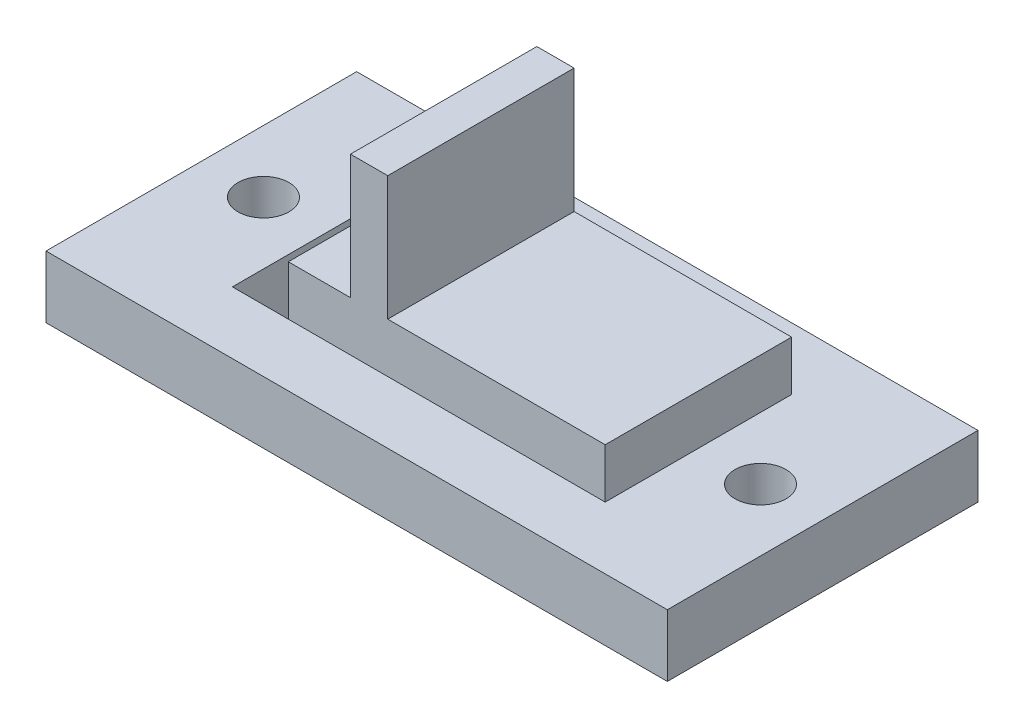
ISO-10303-21;
HEADER;
FILE_DESCRIPTION(('STEP AP214'),'2;1');
FILE_NAME('part.step','',(''),(''),'','','');
FILE_SCHEMA(('AUTOMOTIVE_DESIGN { 1 0 10303 214 1 1 1 1 }'));
ENDSEC;
DATA;
#1=APPLICATION_CONTEXT('core data for automotive mechanical design processes');
#2=APPLICATION_PROTOCOL_DEFINITION('international standard','automotive_design',2000,#1);
#3=PRODUCT_CONTEXT('',#1,'mechanical');
#4=PRODUCT('Part','Part','',(#3));
#5=PRODUCT_RELATED_PRODUCT_CATEGORY('part','',(#4));
#6=PRODUCT_DEFINITION_FORMATION('','',#4);
#7=PRODUCT_DEFINITION_CONTEXT('part definition',#1,'design');
#8=PRODUCT_DEFINITION('design','',#6,#7);
#9=PRODUCT_DEFINITION_SHAPE('','',#8);
#10=(LENGTH_UNIT() NAMED_UNIT(*) SI_UNIT(.MILLI.,.METRE.));
#11=(NAMED_UNIT(*) PLANE_ANGLE_UNIT() SI_UNIT($,.RADIAN.));
#12=(NAMED_UNIT(*) SI_UNIT($,.STERADIAN.) SOLID_ANGLE_UNIT());
#13=UNCERTAINTY_MEASURE_WITH_UNIT(LENGTH_MEASURE(1.E-05),#10,'distance_accuracy_value','');
#14=(GEOMETRIC_REPRESENTATION_CONTEXT(3) GLOBAL_UNCERTAINTY_ASSIGNED_CONTEXT((#13)) GLOBAL_UNIT_ASSIGNED_CONTEXT((#10,
#11,#12)) REPRESENTATION_CONTEXT('',''));
#15=CARTESIAN_POINT('',(0.,0.,0.));
#16=DIRECTION('',(0.,0.,1.));
#17=DIRECTION('',(1.,0.,0.));
#18=AXIS2_PLACEMENT_3D('',#15,#16,#17);
#19=CARTESIAN_POINT('',(0.,4.572,0.));
#20=DIRECTION('',(0.,-1.,0.));
#21=DIRECTION('',(0.,0.,-1.));
#22=AXIS2_PLACEMENT_3D('',#19,#20,#21);
#23=PLANE('',#22);
#24=DIRECTION('',(0.,0.,1.));
#25=VECTOR('',#24,1.);
#26=CARTESIAN_POINT('',(-2.79400000000001,4.572,-3.80999999999999));
#27=LINE('',#26,#25);
#28=CARTESIAN_POINT('',(-2.79400000000001,4.572,-3.80999999999999));
#29=VERTEX_POINT('',#28);
#30=CARTESIAN_POINT('',(-2.79400000000001,4.572,3.81));
#31=VERTEX_POINT('',#30);
#32=EDGE_CURVE('E170',#29,#31,#27,.T.);
#33=ORIENTED_EDGE('',*,*,#32,.F.);
#34=DIRECTION('',(-1.,0.,0.));
#35=VECTOR('',#34,1.);
#36=CARTESIAN_POINT('',(-7.62000000000001,4.572,-3.80999999999999));
#37=LINE('',#36,#35);
#38=CARTESIAN_POINT('',(-5.33400000000001,4.572,-3.80999999999999));
#39=VERTEX_POINT('',#38);
#40=EDGE_CURVE('E224',#29,#39,#37,.T.);
#41=ORIENTED_EDGE('',*,*,#40,.T.);
#42=DIRECTION('',(0.,0.,-1.));
#43=VECTOR('',#42,1.);
#44=CARTESIAN_POINT('',(-5.33400000000001,4.572,3.81));
#45=LINE('',#44,#43);
#46=CARTESIAN_POINT('',(-5.33400000000001,4.572,3.81));
#47=VERTEX_POINT('',#46);
#48=EDGE_CURVE('E171',#47,#39,#45,.T.);
#49=ORIENTED_EDGE('',*,*,#48,.F.);
#50=DIRECTION('',(1.,0.,0.));
#51=VECTOR('',#50,1.);
#52=CARTESIAN_POINT('',(-7.62000000000001,4.572,3.81));
#53=LINE('',#52,#51);
#54=EDGE_CURVE('E64',#47,#31,#53,.T.);
#55=ORIENTED_EDGE('',*,*,#54,.T.);
#56=EDGE_LOOP('',(#33,#41,#49,#55));
#57=FACE_BOUND('',#56,.T.);
#58=ADVANCED_FACE('F41',(#57),#23,.F.);
#59=DIRECTION('',(0.,0.,-1.));
#60=VECTOR('',#59,1.);
#61=CARTESIAN_POINT('',(-1.27000000000001,4.572,-3.80999999999999));
#62=LINE('',#61,#60);
#63=CARTESIAN_POINT('',(-1.27000000000001,4.572,3.81));
#64=VERTEX_POINT('',#63);
#65=CARTESIAN_POINT('',(-1.27000000000001,4.572,-3.80999999999999));
#66=VERTEX_POINT('',#65);
#67=EDGE_CURVE('E56',#64,#66,#62,.T.);
#68=ORIENTED_EDGE('',*,*,#67,.F.);
#69=CARTESIAN_POINT('',(7.62000000000001,4.572,3.81));
#70=VERTEX_POINT('',#69);
#71=EDGE_CURVE('E228',#64,#70,#53,.T.);
#72=ORIENTED_EDGE('',*,*,#71,.T.);
#73=DIRECTION('',(0.,0.,-1.));
#74=VECTOR('',#73,1.);
#75=CARTESIAN_POINT('',(7.62000000000001,4.572,3.81));
#76=LINE('',#75,#74);
#77=CARTESIAN_POINT('',(7.62000000000001,4.572,-3.80999999999999));
#78=VERTEX_POINT('',#77);
#79=EDGE_CURVE('E221',#70,#78,#76,.T.);
#80=ORIENTED_EDGE('',*,*,#79,.T.);
#81=EDGE_CURVE('E226',#78,#66,#37,.T.);
#82=ORIENTED_EDGE('',*,*,#81,.T.);
#83=EDGE_LOOP('',(#68,#72,#80,#82));
#84=FACE_BOUND('',#83,.T.);
#85=ADVANCED_FACE('F299',(#84),#23,.F.);
#86=CARTESIAN_POINT('',(0.,2.54,0.));
#87=DIRECTION('',(0.,-1.,0.));
#88=DIRECTION('',(0.,0.,-1.));
#89=AXIS2_PLACEMENT_3D('',#86,#87,#88);
#90=PLANE('',#89);
#91=CARTESIAN_POINT('',(-10.16,2.54,0.));
#92=DIRECTION('',(0.,-1.,0.));
#93=DIRECTION('',(0.,0.,-1.));
#94=AXIS2_PLACEMENT_3D('',#91,#92,#93);
#95=CIRCLE('',#94,1.0414);
#96=CARTESIAN_POINT('',(-10.16,2.54,-1.0414));
#97=VERTEX_POINT('',#96);
#98=EDGE_CURVE('E217',#97,#97,#95,.T.);
#99=ORIENTED_EDGE('',*,*,#98,.T.);
#100=EDGE_LOOP('',(#99));
#101=FACE_BOUND('',#100,.T.);
#102=CARTESIAN_POINT('',(10.16,2.54,0.));
#103=DIRECTION('',(0.,-1.,0.));
#104=DIRECTION('',(0.,0.,-1.));
#105=AXIS2_PLACEMENT_3D('',#102,#103,#104);
#106=CIRCLE('',#105,1.0414);
#107=CARTESIAN_POINT('',(10.16,2.54,-1.0414));
#108=VERTEX_POINT('',#107);
#109=EDGE_CURVE('E212',#108,#108,#106,.T.);
#110=ORIENTED_EDGE('',*,*,#109,.T.);
#111=EDGE_LOOP('',(#110));
#112=FACE_BOUND('',#111,.T.);
#113=DIRECTION('',(0.,0.,-1.));
#114=VECTOR('',#113,1.);
#115=CARTESIAN_POINT('',(12.7,2.54,6.35));
#116=LINE('',#115,#114);
#117=CARTESIAN_POINT('',(12.7,2.54,6.35));
#118=VERTEX_POINT('',#117);
#119=CARTESIAN_POINT('',(12.7,2.54,-6.34999999999999));
#120=VERTEX_POINT('',#119);
#121=EDGE_CURVE('E246',#118,#120,#116,.T.);
#122=ORIENTED_EDGE('',*,*,#121,.T.);
#123=DIRECTION('',(-1.,0.,0.));
#124=VECTOR('',#123,1.);
#125=CARTESIAN_POINT('',(-12.7,2.54,-6.34999999999999));
#126=LINE('',#125,#124);
#127=CARTESIAN_POINT('',(-12.7,2.54,-6.34999999999999));
#128=VERTEX_POINT('',#127);
#129=EDGE_CURVE('E249',#120,#128,#126,.T.);
#130=ORIENTED_EDGE('',*,*,#129,.T.);
#131=DIRECTION('',(0.,0.,1.));
#132=VECTOR('',#131,1.);
#133=CARTESIAN_POINT('',(-12.7,2.54,6.35));
#134=LINE('',#133,#132);
#135=CARTESIAN_POINT('',(-12.7,2.54,6.35));
#136=VERTEX_POINT('',#135);
#137=EDGE_CURVE('E252',#128,#136,#134,.T.);
#138=ORIENTED_EDGE('',*,*,#137,.T.);
#139=DIRECTION('',(1.,0.,0.));
#140=VECTOR('',#139,1.);
#141=CARTESIAN_POINT('',(-12.7,2.54,6.35));
#142=LINE('',#141,#140);
#143=EDGE_CURVE('E254',#136,#118,#142,.T.);
#144=ORIENTED_EDGE('',*,*,#143,.T.);
#145=EDGE_LOOP('',(#122,#130,#138,#144));
#146=FACE_BOUND('',#145,.T.);
#147=DIRECTION('',(0.,0.,-1.));
#148=VECTOR('',#147,1.);
#149=CARTESIAN_POINT('',(7.62000000000001,2.54,3.81));
#150=LINE('',#149,#148);
#151=CARTESIAN_POINT('',(7.62000000000001,2.54,3.81));
#152=VERTEX_POINT('',#151);
#153=CARTESIAN_POINT('',(7.62000000000001,2.54,-3.80999999999999));
#154=VERTEX_POINT('',#153);
#155=EDGE_CURVE('E220',#152,#154,#150,.T.);
#156=ORIENTED_EDGE('',*,*,#155,.F.);
#157=DIRECTION('',(1.,0.,0.));
#158=VECTOR('',#157,1.);
#159=CARTESIAN_POINT('',(-7.62000000000001,2.54,3.81));
#160=LINE('',#159,#158);
#161=CARTESIAN_POINT('',(-5.33400000000001,2.54,3.81));
#162=VERTEX_POINT('',#161);
#163=EDGE_CURVE('E238',#162,#152,#160,.T.);
#164=ORIENTED_EDGE('',*,*,#163,.F.);
#165=CARTESIAN_POINT('',(-7.62000000000001,2.54,3.81));
#166=VERTEX_POINT('',#165);
#167=EDGE_CURVE('E225',#166,#162,#160,.T.);
#168=ORIENTED_EDGE('',*,*,#167,.F.);
#169=DIRECTION('',(0.,0.,1.));
#170=VECTOR('',#169,1.);
#171=CARTESIAN_POINT('',(-7.62000000000001,2.54,3.81));
#172=LINE('',#171,#170);
#173=CARTESIAN_POINT('',(-7.62000000000001,2.54,-3.80999999999999));
#174=VERTEX_POINT('',#173);
#175=EDGE_CURVE('E236',#174,#166,#172,.T.);
#176=ORIENTED_EDGE('',*,*,#175,.F.);
#177=DIRECTION('',(1.,0.,0.));
#178=VECTOR('',#177,1.);
#179=CARTESIAN_POINT('',(0.,2.54,-3.80999999999999));
#180=LINE('',#179,#178);
#181=CARTESIAN_POINT('',(-5.33400000000001,2.54,-3.80999999999999));
#182=VERTEX_POINT('',#181);
#183=EDGE_CURVE('E205',#174,#182,#180,.T.);
#184=ORIENTED_EDGE('',*,*,#183,.T.);
#185=DIRECTION('',(-1.,0.,0.));
#186=VECTOR('',#185,1.);
#187=CARTESIAN_POINT('',(-7.62000000000001,2.54,-3.80999999999999));
#188=LINE('',#187,#186);
#189=EDGE_CURVE('E233',#154,#182,#188,.T.);
#190=ORIENTED_EDGE('',*,*,#189,.F.);
#191=EDGE_LOOP('',(#156,#164,#168,#176,#184,#190));
#192=FACE_BOUND('',#191,.T.);
#193=ADVANCED_FACE('F289',(#101,#112,#146,#192),#90,.F.);
#194=CARTESIAN_POINT('',(12.7,2.54,6.35));
#195=DIRECTION('',(-1.,0.,0.));
#196=DIRECTION('',(0.,0.,1.));
#197=AXIS2_PLACEMENT_3D('',#194,#195,#196);
#198=PLANE('',#197);
#199=DIRECTION('',(0.,0.,-1.));
#200=VECTOR('',#199,1.);
#201=CARTESIAN_POINT('',(12.7,0.,6.35));
#202=LINE('',#201,#200);
#203=CARTESIAN_POINT('',(12.7,0.,6.35));
#204=VERTEX_POINT('',#203);
#205=CARTESIAN_POINT('',(12.7,0.,-6.34999999999999));
#206=VERTEX_POINT('',#205);
#207=EDGE_CURVE('E245',#204,#206,#202,.T.);
#208=ORIENTED_EDGE('',*,*,#207,.T.);
#209=DIRECTION('',(0.,-1.,0.));
#210=VECTOR('',#209,1.);
#211=CARTESIAN_POINT('',(12.7,2.54,-6.34999999999999));
#212=LINE('',#211,#210);
#213=EDGE_CURVE('E11',#120,#206,#212,.T.);
#214=ORIENTED_EDGE('',*,*,#213,.F.);
#215=ORIENTED_EDGE('',*,*,#121,.F.);
#216=DIRECTION('',(0.,-1.,0.));
#217=VECTOR('',#216,1.);
#218=CARTESIAN_POINT('',(12.7,2.54,6.35));
#219=LINE('',#218,#217);
#220=EDGE_CURVE('E256',#118,#204,#219,.T.);
#221=ORIENTED_EDGE('',*,*,#220,.T.);
#222=EDGE_LOOP('',(#208,#214,#215,#221));
#223=FACE_BOUND('',#222,.T.);
#224=ADVANCED_FACE('F43',(#223),#198,.F.);
#225=CARTESIAN_POINT('',(-12.7,2.54,-6.34999999999999));
#226=DIRECTION('',(0.,0.,1.));
#227=DIRECTION('',(1.,0.,0.));
#228=AXIS2_PLACEMENT_3D('',#225,#226,#227);
#229=PLANE('',#228);
#230=DIRECTION('',(-1.,0.,0.));
#231=VECTOR('',#230,1.);
#232=CARTESIAN_POINT('',(-12.7,0.,-6.34999999999999));
#233=LINE('',#232,#231);
#234=CARTESIAN_POINT('',(-12.7,0.,-6.34999999999999));
#235=VERTEX_POINT('',#234);
#236=EDGE_CURVE('E259',#206,#235,#233,.T.);
#237=ORIENTED_EDGE('',*,*,#236,.T.);
#238=DIRECTION('',(0.,-1.,0.));
#239=VECTOR('',#238,1.);
#240=CARTESIAN_POINT('',(-12.7,2.54,-6.34999999999999));
#241=LINE('',#240,#239);
#242=EDGE_CURVE('E49',#128,#235,#241,.T.);
#243=ORIENTED_EDGE('',*,*,#242,.F.);
#244=ORIENTED_EDGE('',*,*,#129,.F.);
#245=ORIENTED_EDGE('',*,*,#213,.T.);
#246=EDGE_LOOP('',(#237,#243,#244,#245));
#247=FACE_BOUND('',#246,.T.);
#248=ADVANCED_FACE('F291',(#247),#229,.F.);
#249=CARTESIAN_POINT('',(-12.7,2.54,6.35));
#250=DIRECTION('',(1.,0.,0.));
#251=DIRECTION('',(0.,0.,-1.));
#252=AXIS2_PLACEMENT_3D('',#249,#250,#251);
#253=PLANE('',#252);
#254=DIRECTION('',(0.,0.,1.));
#255=VECTOR('',#254,1.);
#256=CARTESIAN_POINT('',(-12.7,0.,6.35));
#257=LINE('',#256,#255);
#258=CARTESIAN_POINT('',(-12.7,0.,6.35));
#259=VERTEX_POINT('',#258);
#260=EDGE_CURVE('E262',#235,#259,#257,.T.);
#261=ORIENTED_EDGE('',*,*,#260,.T.);
#262=DIRECTION('',(0.,-1.,0.));
#263=VECTOR('',#262,1.);
#264=CARTESIAN_POINT('',(-12.7,2.54,6.35));
#265=LINE('',#264,#263);
#266=EDGE_CURVE('E267',#136,#259,#265,.T.);
#267=ORIENTED_EDGE('',*,*,#266,.F.);
#268=ORIENTED_EDGE('',*,*,#137,.F.);
#269=ORIENTED_EDGE('',*,*,#242,.T.);
#270=EDGE_LOOP('',(#261,#267,#268,#269));
#271=FACE_BOUND('',#270,.T.);
#272=ADVANCED_FACE('F274',(#271),#253,.F.);
#273=CARTESIAN_POINT('',(-12.7,2.54,6.35));
#274=DIRECTION('',(0.,0.,-1.));
#275=DIRECTION('',(-1.,0.,0.));
#276=AXIS2_PLACEMENT_3D('',#273,#274,#275);
#277=PLANE('',#276);
#278=DIRECTION('',(1.,0.,0.));
#279=VECTOR('',#278,1.);
#280=CARTESIAN_POINT('',(-12.7,0.,6.35));
#281=LINE('',#280,#279);
#282=EDGE_CURVE('E250',#259,#204,#281,.T.);
#283=ORIENTED_EDGE('',*,*,#282,.T.);
#284=ORIENTED_EDGE('',*,*,#220,.F.);
#285=ORIENTED_EDGE('',*,*,#143,.F.);
#286=ORIENTED_EDGE('',*,*,#266,.T.);
#287=EDGE_LOOP('',(#283,#284,#285,#286));
#288=FACE_BOUND('',#287,.T.);
#289=ADVANCED_FACE('F283',(#288),#277,.F.);
#290=CARTESIAN_POINT('',(0.,0.,0.));
#291=DIRECTION('',(0.,-1.,0.));
#292=DIRECTION('',(0.,0.,-1.));
#293=AXIS2_PLACEMENT_3D('',#290,#291,#292);
#294=PLANE('',#293);
#295=DIRECTION('',(1.,0.,0.));
#296=VECTOR('',#295,1.);
#297=CARTESIAN_POINT('',(-7.62000000000001,0.,3.81));
#298=LINE('',#297,#296);
#299=CARTESIAN_POINT('',(-7.62000000000001,0.,3.81));
#300=VERTEX_POINT('',#299);
#301=CARTESIAN_POINT('',(-5.33400000000001,0.,3.81));
#302=VERTEX_POINT('',#301);
#303=EDGE_CURVE('E174',#300,#302,#298,.T.);
#304=ORIENTED_EDGE('',*,*,#303,.T.);
#305=DIRECTION('',(0.,0.,-1.));
#306=VECTOR('',#305,1.);
#307=CARTESIAN_POINT('',(-5.33400000000001,0.,3.81));
#308=LINE('',#307,#306);
#309=CARTESIAN_POINT('',(-5.33400000000001,0.,-3.80999999999999));
#310=VERTEX_POINT('',#309);
#311=EDGE_CURVE('E192',#302,#310,#308,.T.);
#312=ORIENTED_EDGE('',*,*,#311,.T.);
#313=DIRECTION('',(-1.,0.,0.));
#314=VECTOR('',#313,1.);
#315=CARTESIAN_POINT('',(-7.62000000000001,0.,-3.80999999999999));
#316=LINE('',#315,#314);
#317=CARTESIAN_POINT('',(-7.62000000000001,0.,-3.80999999999999));
#318=VERTEX_POINT('',#317);
#319=EDGE_CURVE('E188',#310,#318,#316,.T.);
#320=ORIENTED_EDGE('',*,*,#319,.T.);
#321=DIRECTION('',(0.,0.,1.));
#322=VECTOR('',#321,1.);
#323=CARTESIAN_POINT('',(-7.62000000000001,0.,3.81));
#324=LINE('',#323,#322);
#325=EDGE_CURVE('E183',#318,#300,#324,.T.);
#326=ORIENTED_EDGE('',*,*,#325,.T.);
#327=EDGE_LOOP('',(#304,#312,#320,#326));
#328=FACE_BOUND('',#327,.T.);
#329=CARTESIAN_POINT('',(-10.16,0.,0.));
#330=DIRECTION('',(0.,-1.,0.));
#331=DIRECTION('',(0.,0.,-1.));
#332=AXIS2_PLACEMENT_3D('',#329,#330,#331);
#333=CIRCLE('',#332,1.0414);
#334=CARTESIAN_POINT('',(-10.16,0.,-1.0414));
#335=VERTEX_POINT('',#334);
#336=EDGE_CURVE('E209',#335,#335,#333,.T.);
#337=ORIENTED_EDGE('',*,*,#336,.F.);
#338=EDGE_LOOP('',(#337));
#339=FACE_BOUND('',#338,.T.);
#340=CARTESIAN_POINT('',(10.16,0.,0.));
#341=DIRECTION('',(0.,-1.,0.));
#342=DIRECTION('',(0.,0.,-1.));
#343=AXIS2_PLACEMENT_3D('',#340,#341,#342);
#344=CIRCLE('',#343,1.0414);
#345=CARTESIAN_POINT('',(10.16,0.,-1.0414));
#346=VERTEX_POINT('',#345);
#347=EDGE_CURVE('E208',#346,#346,#344,.T.);
#348=ORIENTED_EDGE('',*,*,#347,.F.);
#349=EDGE_LOOP('',(#348));
#350=FACE_BOUND('',#349,.T.);
#351=ORIENTED_EDGE('',*,*,#207,.F.);
#352=ORIENTED_EDGE('',*,*,#282,.F.);
#353=ORIENTED_EDGE('',*,*,#260,.F.);
#354=ORIENTED_EDGE('',*,*,#236,.F.);
#355=EDGE_LOOP('',(#351,#352,#353,#354));
#356=FACE_BOUND('',#355,.T.);
#357=ADVANCED_FACE('F280',(#328,#339,#350,#356),#294,.T.);
#358=CARTESIAN_POINT('',(7.62000000000001,4.572,3.81));
#359=DIRECTION('',(-1.,0.,0.));
#360=DIRECTION('',(0.,0.,1.));
#361=AXIS2_PLACEMENT_3D('',#358,#359,#360);
#362=PLANE('',#361);
#363=ORIENTED_EDGE('',*,*,#155,.T.);
#364=DIRECTION('',(0.,-1.,0.));
#365=VECTOR('',#364,1.);
#366=CARTESIAN_POINT('',(7.62000000000001,4.572,-3.80999999999999));
#367=LINE('',#366,#365);
#368=EDGE_CURVE('E242',#78,#154,#367,.T.);
#369=ORIENTED_EDGE('',*,*,#368,.F.);
#370=ORIENTED_EDGE('',*,*,#79,.F.);
#371=DIRECTION('',(0.,-1.,0.));
#372=VECTOR('',#371,1.);
#373=CARTESIAN_POINT('',(7.62000000000001,4.572,3.81));
#374=LINE('',#373,#372);
#375=EDGE_CURVE('E230',#70,#152,#374,.T.);
#376=ORIENTED_EDGE('',*,*,#375,.T.);
#377=EDGE_LOOP('',(#363,#369,#370,#376));
#378=FACE_BOUND('',#377,.T.);
#379=ADVANCED_FACE('F314',(#378),#362,.F.);
#380=CARTESIAN_POINT('',(-7.62000000000001,4.572,-3.80999999999999));
#381=DIRECTION('',(0.,0.,1.));
#382=DIRECTION('',(1.,0.,0.));
#383=AXIS2_PLACEMENT_3D('',#380,#381,#382);
#384=PLANE('',#383);
#385=ORIENTED_EDGE('',*,*,#189,.T.);
#386=DIRECTION('',(0.,1.,0.));
#387=VECTOR('',#386,1.);
#388=CARTESIAN_POINT('',(-5.33400000000001,-7.95551355978983,-3.80999999999999));
#389=LINE('',#388,#387);
#390=EDGE_CURVE('E195',#182,#39,#389,.T.);
#391=ORIENTED_EDGE('',*,*,#390,.T.);
#392=ORIENTED_EDGE('',*,*,#40,.F.);
#393=DIRECTION('',(0.,-1.,0.));
#394=VECTOR('',#393,1.);
#395=CARTESIAN_POINT('',(-2.79400000000001,9.652,-3.80999999999999));
#396=LINE('',#395,#394);
#397=CARTESIAN_POINT('',(-2.79400000000001,9.652,-3.80999999999999));
#398=VERTEX_POINT('',#397);
#399=EDGE_CURVE('E457',#398,#29,#396,.T.);
#400=ORIENTED_EDGE('',*,*,#399,.F.);
#401=DIRECTION('',(-1.,0.,0.));
#402=VECTOR('',#401,1.);
#403=CARTESIAN_POINT('',(-2.79400000000001,9.652,-3.80999999999999));
#404=LINE('',#403,#402);
#405=CARTESIAN_POINT('',(-1.27000000000001,9.652,-3.80999999999999));
#406=VERTEX_POINT('',#405);
#407=EDGE_CURVE('E164',#406,#398,#404,.T.);
#408=ORIENTED_EDGE('',*,*,#407,.F.);
#409=DIRECTION('',(0.,-1.,0.));
#410=VECTOR('',#409,1.);
#411=CARTESIAN_POINT('',(-1.27000000000001,9.652,-3.80999999999999));
#412=LINE('',#411,#410);
#413=EDGE_CURVE('E176',#406,#66,#412,.T.);
#414=ORIENTED_EDGE('',*,*,#413,.T.);
#415=ORIENTED_EDGE('',*,*,#81,.F.);
#416=ORIENTED_EDGE('',*,*,#368,.T.);
#417=EDGE_LOOP('',(#385,#391,#392,#400,#408,#414,#415,#416));
#418=FACE_BOUND('',#417,.T.);
#419=ADVANCED_FACE('F311',(#418),#384,.F.);
#420=CARTESIAN_POINT('',(-7.62000000000001,4.572,3.81));
#421=DIRECTION('',(0.,0.,-1.));
#422=DIRECTION('',(-1.,0.,0.));
#423=AXIS2_PLACEMENT_3D('',#420,#421,#422);
#424=PLANE('',#423);
#425=ORIENTED_EDGE('',*,*,#54,.F.);
#426=DIRECTION('',(0.,1.,0.));
#427=VECTOR('',#426,1.);
#428=CARTESIAN_POINT('',(-5.33400000000001,-7.95551355978983,3.81));
#429=LINE('',#428,#427);
#430=EDGE_CURVE('E182',#162,#47,#429,.T.);
#431=ORIENTED_EDGE('',*,*,#430,.F.);
#432=ORIENTED_EDGE('',*,*,#163,.T.);
#433=ORIENTED_EDGE('',*,*,#375,.F.);
#434=ORIENTED_EDGE('',*,*,#71,.F.);
#435=DIRECTION('',(0.,-1.,0.));
#436=VECTOR('',#435,1.);
#437=CARTESIAN_POINT('',(-1.27000000000001,9.652,3.81));
#438=LINE('',#437,#436);
#439=CARTESIAN_POINT('',(-1.27000000000001,9.652,3.81));
#440=VERTEX_POINT('',#439);
#441=EDGE_CURVE('E155',#440,#64,#438,.T.);
#442=ORIENTED_EDGE('',*,*,#441,.F.);
#443=DIRECTION('',(1.,0.,0.));
#444=VECTOR('',#443,1.);
#445=CARTESIAN_POINT('',(-2.79400000000001,9.652,3.81));
#446=LINE('',#445,#444);
#447=CARTESIAN_POINT('',(-2.79400000000001,9.652,3.81));
#448=VERTEX_POINT('',#447);
#449=EDGE_CURVE('E148',#448,#440,#446,.T.);
#450=ORIENTED_EDGE('',*,*,#449,.F.);
#451=DIRECTION('',(0.,-1.,0.));
#452=VECTOR('',#451,1.);
#453=CARTESIAN_POINT('',(-2.79400000000001,9.652,3.81));
#454=LINE('',#453,#452);
#455=EDGE_CURVE('E152',#448,#31,#454,.T.);
#456=ORIENTED_EDGE('',*,*,#455,.T.);
#457=EDGE_LOOP('',(#425,#431,#432,#433,#434,#442,#450,#456));
#458=FACE_BOUND('',#457,.T.);
#459=ADVANCED_FACE('F150',(#458),#424,.F.);
#460=CARTESIAN_POINT('',(10.16,4.572,0.));
#461=DIRECTION('',(0.,-1.,0.));
#462=DIRECTION('',(0.,0.,-1.));
#463=AXIS2_PLACEMENT_3D('',#460,#461,#462);
#464=CYLINDRICAL_SURFACE('',#463,1.0414);
#465=ORIENTED_EDGE('',*,*,#347,.T.);
#466=EDGE_LOOP('',(#465));
#467=FACE_BOUND('',#466,.T.);
#468=ORIENTED_EDGE('',*,*,#109,.F.);
#469=EDGE_LOOP('',(#468));
#470=FACE_BOUND('',#469,.T.);
#471=ADVANCED_FACE('F307',(#467,#470),#464,.F.);
#472=CARTESIAN_POINT('',(-10.16,4.572,0.));
#473=DIRECTION('',(0.,-1.,0.));
#474=DIRECTION('',(0.,0.,-1.));
#475=AXIS2_PLACEMENT_3D('',#472,#473,#474);
#476=CYLINDRICAL_SURFACE('',#475,1.0414);
#477=ORIENTED_EDGE('',*,*,#336,.T.);
#478=EDGE_LOOP('',(#477));
#479=FACE_BOUND('',#478,.T.);
#480=ORIENTED_EDGE('',*,*,#98,.F.);
#481=EDGE_LOOP('',(#480));
#482=FACE_BOUND('',#481,.T.);
#483=ADVANCED_FACE('F373',(#479,#482),#476,.F.);
#484=CARTESIAN_POINT('',(-7.62000000000001,-7.95551355978983,3.81));
#485=DIRECTION('',(0.,0.,1.));
#486=DIRECTION('',(1.,0.,0.));
#487=AXIS2_PLACEMENT_3D('',#484,#485,#486);
#488=PLANE('',#487);
#489=EDGE_CURVE('E196',#302,#162,#429,.T.);
#490=ORIENTED_EDGE('',*,*,#489,.F.);
#491=ORIENTED_EDGE('',*,*,#303,.F.);
#492=DIRECTION('',(0.,1.,0.));
#493=VECTOR('',#492,1.);
#494=CARTESIAN_POINT('',(-7.62000000000001,-7.95551355978983,3.81));
#495=LINE('',#494,#493);
#496=EDGE_CURVE('E186',#300,#166,#495,.T.);
#497=ORIENTED_EDGE('',*,*,#496,.T.);
#498=ORIENTED_EDGE('',*,*,#167,.T.);
#499=EDGE_LOOP('',(#490,#491,#497,#498));
#500=FACE_BOUND('',#499,.T.);
#501=ADVANCED_FACE('F380',(#500),#488,.F.);
#502=CARTESIAN_POINT('',(-7.62000000000001,-7.95551355978983,-3.80999999999999));
#503=DIRECTION('',(0.,0.,-1.));
#504=DIRECTION('',(-1.,0.,0.));
#505=AXIS2_PLACEMENT_3D('',#502,#503,#504);
#506=PLANE('',#505);
#507=DIRECTION('',(0.,1.,0.));
#508=VECTOR('',#507,1.);
#509=CARTESIAN_POINT('',(-7.62000000000001,-7.95551355978983,-3.80999999999999));
#510=LINE('',#509,#508);
#511=EDGE_CURVE('E187',#318,#174,#510,.T.);
#512=ORIENTED_EDGE('',*,*,#511,.F.);
#513=ORIENTED_EDGE('',*,*,#319,.F.);
#514=EDGE_CURVE('E191',#310,#182,#389,.T.);
#515=ORIENTED_EDGE('',*,*,#514,.T.);
#516=ORIENTED_EDGE('',*,*,#183,.F.);
#517=EDGE_LOOP('',(#512,#513,#515,#516));
#518=FACE_BOUND('',#517,.T.);
#519=ADVANCED_FACE('F387',(#518),#506,.F.);
#520=CARTESIAN_POINT('',(-7.62000000000001,-7.95551355978983,3.81));
#521=DIRECTION('',(-1.,0.,0.));
#522=DIRECTION('',(0.,0.,1.));
#523=AXIS2_PLACEMENT_3D('',#520,#521,#522);
#524=PLANE('',#523);
#525=ORIENTED_EDGE('',*,*,#496,.F.);
#526=ORIENTED_EDGE('',*,*,#325,.F.);
#527=ORIENTED_EDGE('',*,*,#511,.T.);
#528=ORIENTED_EDGE('',*,*,#175,.T.);
#529=EDGE_LOOP('',(#525,#526,#527,#528));
#530=FACE_BOUND('',#529,.T.);
#531=ADVANCED_FACE('F396',(#530),#524,.F.);
#532=CARTESIAN_POINT('',(-5.33400000000001,-7.95551355978983,3.81));
#533=DIRECTION('',(1.,0.,0.));
#534=DIRECTION('',(0.,0.,-1.));
#535=AXIS2_PLACEMENT_3D('',#532,#533,#534);
#536=PLANE('',#535);
#537=ORIENTED_EDGE('',*,*,#489,.T.);
#538=ORIENTED_EDGE('',*,*,#430,.T.);
#539=ORIENTED_EDGE('',*,*,#48,.T.);
#540=ORIENTED_EDGE('',*,*,#390,.F.);
#541=ORIENTED_EDGE('',*,*,#514,.F.);
#542=ORIENTED_EDGE('',*,*,#311,.F.);
#543=EDGE_LOOP('',(#537,#538,#539,#540,#541,#542));
#544=FACE_BOUND('',#543,.T.);
#545=ADVANCED_FACE('F405',(#544),#536,.F.);
#546=CARTESIAN_POINT('',(-2.79400000000001,9.652,-3.80999999999999));
#547=DIRECTION('',(1.,0.,0.));
#548=DIRECTION('',(0.,0.,-1.));
#549=AXIS2_PLACEMENT_3D('',#546,#547,#548);
#550=PLANE('',#549);
#551=ORIENTED_EDGE('',*,*,#32,.T.);
#552=ORIENTED_EDGE('',*,*,#455,.F.);
#553=DIRECTION('',(0.,0.,1.));
#554=VECTOR('',#553,1.);
#555=CARTESIAN_POINT('',(-2.79400000000001,9.652,-3.80999999999999));
#556=LINE('',#555,#554);
#557=EDGE_CURVE('E159',#398,#448,#556,.T.);
#558=ORIENTED_EDGE('',*,*,#557,.F.);
#559=ORIENTED_EDGE('',*,*,#399,.T.);
#560=EDGE_LOOP('',(#551,#552,#558,#559));
#561=FACE_BOUND('',#560,.T.);
#562=ADVANCED_FACE('F169',(#561),#550,.F.);
#563=CARTESIAN_POINT('',(-1.27000000000001,9.652,-3.80999999999999));
#564=DIRECTION('',(-1.,0.,0.));
#565=DIRECTION('',(0.,0.,1.));
#566=AXIS2_PLACEMENT_3D('',#563,#564,#565);
#567=PLANE('',#566);
#568=ORIENTED_EDGE('',*,*,#67,.T.);
#569=ORIENTED_EDGE('',*,*,#413,.F.);
#570=DIRECTION('',(0.,0.,-1.));
#571=VECTOR('',#570,1.);
#572=CARTESIAN_POINT('',(-1.27000000000001,9.652,-3.80999999999999));
#573=LINE('',#572,#571);
#574=EDGE_CURVE('E158',#440,#406,#573,.T.);
#575=ORIENTED_EDGE('',*,*,#574,.F.);
#576=ORIENTED_EDGE('',*,*,#441,.T.);
#577=EDGE_LOOP('',(#568,#569,#575,#576));
#578=FACE_BOUND('',#577,.T.);
#579=ADVANCED_FACE('F433',(#578),#567,.F.);
#580=CARTESIAN_POINT('',(0.,9.652,0.));
#581=DIRECTION('',(0.,1.,0.));
#582=DIRECTION('',(0.,0.,1.));
#583=AXIS2_PLACEMENT_3D('',#580,#581,#582);
#584=PLANE('',#583);
#585=ORIENTED_EDGE('',*,*,#557,.T.);
#586=ORIENTED_EDGE('',*,*,#449,.T.);
#587=ORIENTED_EDGE('',*,*,#574,.T.);
#588=ORIENTED_EDGE('',*,*,#407,.T.);
#589=EDGE_LOOP('',(#585,#586,#587,#588));
#590=FACE_BOUND('',#589,.T.);
#591=ADVANCED_FACE('F162',(#590),#584,.T.);
#592=CLOSED_SHELL('',(#58,#85,#193,#224,#248,#272,#289,#357,#379,#419,#459,#471,#483,#501,#519,
#531,#545,#562,#579,#591));
#593=MANIFOLD_SOLID_BREP('B2',#592);
#594=ADVANCED_BREP_SHAPE_REPRESENTATION('',(#18,#593),#14);
#595=SHAPE_DEFINITION_REPRESENTATION(#9,#594);
ENDSEC;
END-ISO-10303-21;
